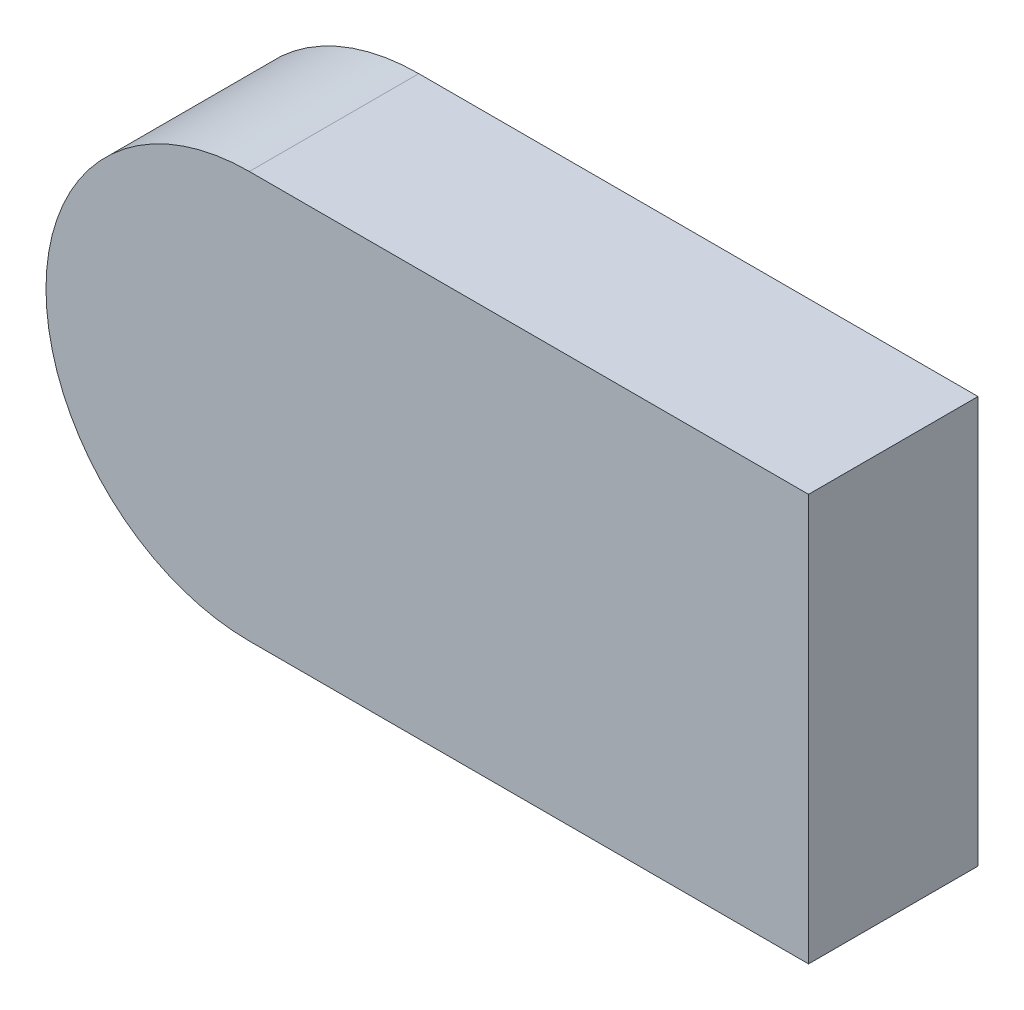
ISO-10303-21;
HEADER;
FILE_DESCRIPTION(('STEP AP214'),'2;1');
FILE_NAME('part.step','',(''),(''),'','','');
FILE_SCHEMA(('AUTOMOTIVE_DESIGN { 1 0 10303 214 1 1 1 1 }'));
ENDSEC;
DATA;
#1=APPLICATION_CONTEXT('core data for automotive mechanical design processes');
#2=APPLICATION_PROTOCOL_DEFINITION('international standard','automotive_design',2000,#1);
#3=PRODUCT_CONTEXT('',#1,'mechanical');
#4=PRODUCT('Part','Part','',(#3));
#5=PRODUCT_RELATED_PRODUCT_CATEGORY('part','',(#4));
#6=PRODUCT_DEFINITION_FORMATION('','',#4);
#7=PRODUCT_DEFINITION_CONTEXT('part definition',#1,'design');
#8=PRODUCT_DEFINITION('design','',#6,#7);
#9=PRODUCT_DEFINITION_SHAPE('','',#8);
#10=(LENGTH_UNIT() NAMED_UNIT(*) SI_UNIT(.MILLI.,.METRE.));
#11=(NAMED_UNIT(*) PLANE_ANGLE_UNIT() SI_UNIT($,.RADIAN.));
#12=(NAMED_UNIT(*) SI_UNIT($,.STERADIAN.) SOLID_ANGLE_UNIT());
#13=UNCERTAINTY_MEASURE_WITH_UNIT(LENGTH_MEASURE(1.E-05),#10,'distance_accuracy_value','');
#14=(GEOMETRIC_REPRESENTATION_CONTEXT(3) GLOBAL_UNCERTAINTY_ASSIGNED_CONTEXT((#13)) GLOBAL_UNIT_ASSIGNED_CONTEXT((#10,
#11,#12)) REPRESENTATION_CONTEXT('',''));
#15=CARTESIAN_POINT('',(0.,0.,0.));
#16=DIRECTION('',(0.,0.,1.));
#17=DIRECTION('',(1.,0.,0.));
#18=AXIS2_PLACEMENT_3D('',#15,#16,#17);
#19=CARTESIAN_POINT('',(4.05,0.13,0.));
#20=DIRECTION('',(0.,-1.,0.));
#21=DIRECTION('',(-1.,0.,0.));
#22=AXIS2_PLACEMENT_3D('',#19,#20,#21);
#23=PLANE('',#22);
#24=DIRECTION('',(0.,0.,1.));
#25=VECTOR('',#24,1.);
#26=CARTESIAN_POINT('',(4.05,0.13,0.));
#27=LINE('',#26,#25);
#28=CARTESIAN_POINT('',(4.05,0.13,0.));
#29=VERTEX_POINT('',#28);
#30=CARTESIAN_POINT('',(4.05,0.13,0.1));
#31=VERTEX_POINT('',#30);
#32=EDGE_CURVE('E11',#29,#31,#27,.T.);
#33=ORIENTED_EDGE('',*,*,#32,.T.);
#34=DIRECTION('',(-1.,0.,0.));
#35=VECTOR('',#34,1.);
#36=CARTESIAN_POINT('',(4.05,0.13,0.1));
#37=LINE('',#36,#35);
#38=CARTESIAN_POINT('',(3.72,0.13,0.1));
#39=VERTEX_POINT('',#38);
#40=EDGE_CURVE('E24',#31,#39,#37,.T.);
#41=ORIENTED_EDGE('',*,*,#40,.T.);
#42=DIRECTION('',(0.,0.,1.));
#43=VECTOR('',#42,1.);
#44=CARTESIAN_POINT('',(3.72,0.13,0.));
#45=LINE('',#44,#43);
#46=CARTESIAN_POINT('',(3.72,0.13,0.));
#47=VERTEX_POINT('',#46);
#48=EDGE_CURVE('E86',#47,#39,#45,.T.);
#49=ORIENTED_EDGE('',*,*,#48,.F.);
#50=DIRECTION('',(-1.,0.,0.));
#51=VECTOR('',#50,1.);
#52=CARTESIAN_POINT('',(4.05,0.13,0.));
#53=LINE('',#52,#51);
#54=EDGE_CURVE('E83',#29,#47,#53,.T.);
#55=ORIENTED_EDGE('',*,*,#54,.F.);
#56=EDGE_LOOP('',(#33,#41,#49,#55));
#57=FACE_BOUND('',#56,.T.);
#58=ADVANCED_FACE('F17',(#57),#23,.T.);
#59=CARTESIAN_POINT('',(3.72,0.25,0.));
#60=DIRECTION('',(0.,0.,-1.));
#61=DIRECTION('',(1.,0.,0.));
#62=AXIS2_PLACEMENT_3D('',#59,#60,#61);
#63=CYLINDRICAL_SURFACE('',#62,0.12);
#64=CARTESIAN_POINT('',(3.72,0.25,0.));
#65=DIRECTION('',(0.,0.,1.));
#66=DIRECTION('',(1.,0.,0.));
#67=AXIS2_PLACEMENT_3D('',#64,#65,#66);
#68=CIRCLE('',#67,0.12);
#69=CARTESIAN_POINT('',(3.72,0.37,0.));
#70=VERTEX_POINT('',#69);
#71=EDGE_CURVE('E80',#70,#47,#68,.T.);
#72=ORIENTED_EDGE('',*,*,#71,.T.);
#73=ORIENTED_EDGE('',*,*,#48,.T.);
#74=CARTESIAN_POINT('',(3.72,0.25,0.1));
#75=DIRECTION('',(0.,0.,1.));
#76=DIRECTION('',(1.,0.,0.));
#77=AXIS2_PLACEMENT_3D('',#74,#75,#76);
#78=CIRCLE('',#77,0.12);
#79=CARTESIAN_POINT('',(3.72,0.37,0.1));
#80=VERTEX_POINT('',#79);
#81=EDGE_CURVE('E78',#80,#39,#78,.T.);
#82=ORIENTED_EDGE('',*,*,#81,.F.);
#83=DIRECTION('',(0.,0.,1.));
#84=VECTOR('',#83,1.);
#85=CARTESIAN_POINT('',(3.72,0.37,0.));
#86=LINE('',#85,#84);
#87=EDGE_CURVE('E67',#70,#80,#86,.T.);
#88=ORIENTED_EDGE('',*,*,#87,.F.);
#89=EDGE_LOOP('',(#72,#73,#82,#88));
#90=FACE_BOUND('',#89,.T.);
#91=ADVANCED_FACE('F89',(#90),#63,.T.);
#92=CARTESIAN_POINT('',(4.05,0.37,0.));
#93=DIRECTION('',(0.,-1.,0.));
#94=DIRECTION('',(-1.,0.,0.));
#95=AXIS2_PLACEMENT_3D('',#92,#93,#94);
#96=PLANE('',#95);
#97=DIRECTION('',(-1.,0.,0.));
#98=VECTOR('',#97,1.);
#99=CARTESIAN_POINT('',(4.05,0.37,0.));
#100=LINE('',#99,#98);
#101=CARTESIAN_POINT('',(4.05,0.37,0.));
#102=VERTEX_POINT('',#101);
#103=EDGE_CURVE('E70',#102,#70,#100,.T.);
#104=ORIENTED_EDGE('',*,*,#103,.T.);
#105=ORIENTED_EDGE('',*,*,#87,.T.);
#106=DIRECTION('',(-1.,0.,0.));
#107=VECTOR('',#106,1.);
#108=CARTESIAN_POINT('',(4.05,0.37,0.1));
#109=LINE('',#108,#107);
#110=CARTESIAN_POINT('',(4.05,0.37,0.1));
#111=VERTEX_POINT('',#110);
#112=EDGE_CURVE('E61',#111,#80,#109,.T.);
#113=ORIENTED_EDGE('',*,*,#112,.F.);
#114=DIRECTION('',(0.,0.,1.));
#115=VECTOR('',#114,1.);
#116=CARTESIAN_POINT('',(4.05,0.37,0.));
#117=LINE('',#116,#115);
#118=EDGE_CURVE('E51',#102,#111,#117,.T.);
#119=ORIENTED_EDGE('',*,*,#118,.F.);
#120=EDGE_LOOP('',(#104,#105,#113,#119));
#121=FACE_BOUND('',#120,.T.);
#122=ADVANCED_FACE('F65',(#121),#96,.F.);
#123=CARTESIAN_POINT('',(4.05,0.13,0.));
#124=DIRECTION('',(-1.,0.,0.));
#125=DIRECTION('',(0.,1.,0.));
#126=AXIS2_PLACEMENT_3D('',#123,#124,#125);
#127=PLANE('',#126);
#128=DIRECTION('',(0.,1.,0.));
#129=VECTOR('',#128,1.);
#130=CARTESIAN_POINT('',(4.05,0.13,0.));
#131=LINE('',#130,#129);
#132=EDGE_CURVE('E57',#29,#102,#131,.T.);
#133=ORIENTED_EDGE('',*,*,#132,.T.);
#134=ORIENTED_EDGE('',*,*,#118,.T.);
#135=DIRECTION('',(0.,1.,0.));
#136=VECTOR('',#135,1.);
#137=CARTESIAN_POINT('',(4.05,0.13,0.1));
#138=LINE('',#137,#136);
#139=EDGE_CURVE('E55',#31,#111,#138,.T.);
#140=ORIENTED_EDGE('',*,*,#139,.F.);
#141=ORIENTED_EDGE('',*,*,#32,.F.);
#142=EDGE_LOOP('',(#133,#134,#140,#141));
#143=FACE_BOUND('',#142,.T.);
#144=ADVANCED_FACE('F53',(#143),#127,.F.);
#145=CARTESIAN_POINT('',(3.849490847913,0.25,0.));
#146=DIRECTION('',(0.,0.,-1.));
#147=DIRECTION('',(-1.,0.,0.));
#148=AXIS2_PLACEMENT_3D('',#145,#146,#147);
#149=PLANE('',#148);
#150=ORIENTED_EDGE('',*,*,#54,.T.);
#151=ORIENTED_EDGE('',*,*,#71,.F.);
#152=ORIENTED_EDGE('',*,*,#103,.F.);
#153=ORIENTED_EDGE('',*,*,#132,.F.);
#154=EDGE_LOOP('',(#150,#151,#152,#153));
#155=FACE_BOUND('',#154,.T.);
#156=ADVANCED_FACE('F91',(#155),#149,.T.);
#157=CARTESIAN_POINT('',(3.849490847913,0.25,0.1));
#158=DIRECTION('',(0.,0.,-1.));
#159=DIRECTION('',(-1.,0.,0.));
#160=AXIS2_PLACEMENT_3D('',#157,#158,#159);
#161=PLANE('',#160);
#162=ORIENTED_EDGE('',*,*,#139,.T.);
#163=ORIENTED_EDGE('',*,*,#112,.T.);
#164=ORIENTED_EDGE('',*,*,#81,.T.);
#165=ORIENTED_EDGE('',*,*,#40,.F.);
#166=EDGE_LOOP('',(#162,#163,#164,#165));
#167=FACE_BOUND('',#166,.T.);
#168=ADVANCED_FACE('F72',(#167),#161,.F.);
#169=CLOSED_SHELL('',(#58,#91,#122,#144,#156,#168));
#170=MANIFOLD_SOLID_BREP('B1',#169);
#171=ADVANCED_BREP_SHAPE_REPRESENTATION('',(#18,#170),#14);
#172=SHAPE_DEFINITION_REPRESENTATION(#9,#171);
ENDSEC;
END-ISO-10303-21;
